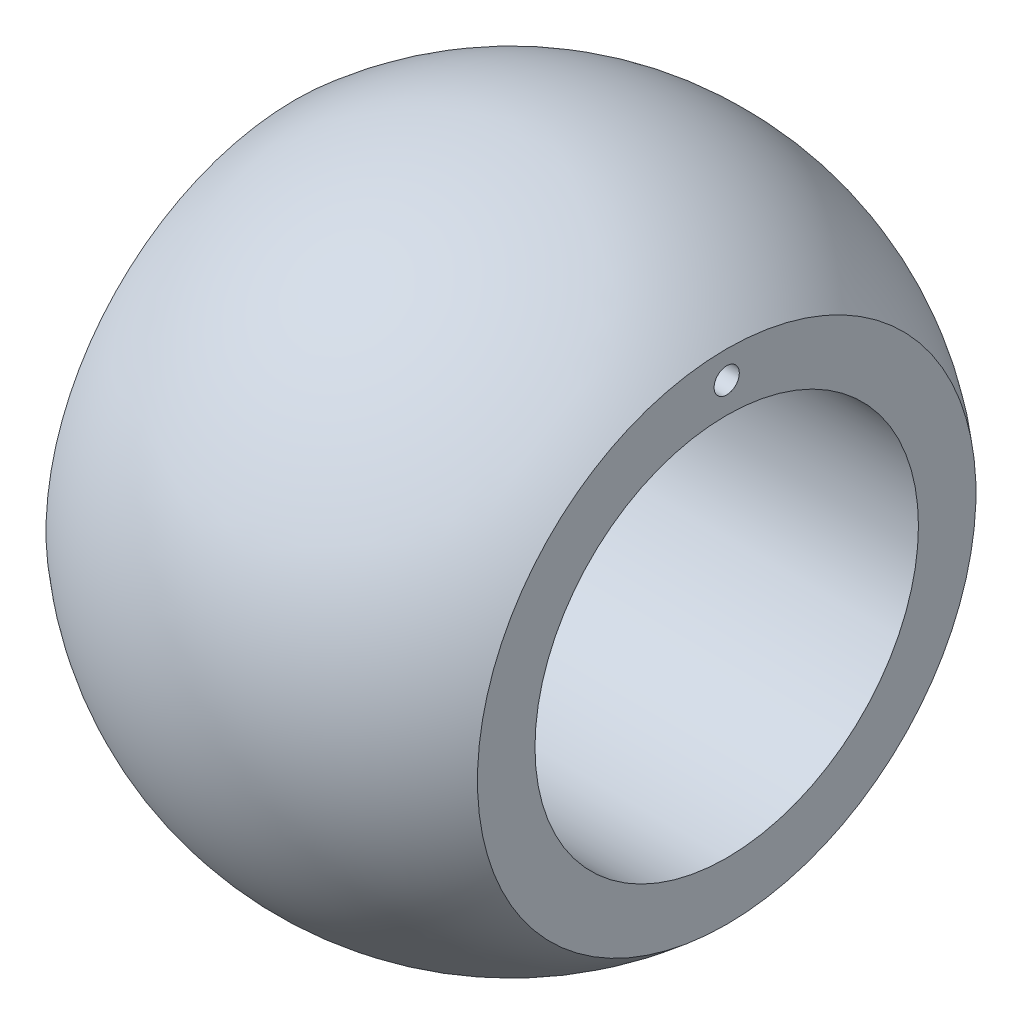
ISO-10303-21;
HEADER;
FILE_DESCRIPTION(('STEP AP214'),'2;1');
FILE_NAME('part.step','',(''),(''),'','','');
FILE_SCHEMA(('AUTOMOTIVE_DESIGN { 1 0 10303 214 1 1 1 1 }'));
ENDSEC;
DATA;
#1=APPLICATION_CONTEXT('core data for automotive mechanical design processes');
#2=APPLICATION_PROTOCOL_DEFINITION('international standard','automotive_design',2000,#1);
#3=PRODUCT_CONTEXT('',#1,'mechanical');
#4=PRODUCT('Part','Part','',(#3));
#5=PRODUCT_RELATED_PRODUCT_CATEGORY('part','',(#4));
#6=PRODUCT_DEFINITION_FORMATION('','',#4);
#7=PRODUCT_DEFINITION_CONTEXT('part definition',#1,'design');
#8=PRODUCT_DEFINITION('design','',#6,#7);
#9=PRODUCT_DEFINITION_SHAPE('','',#8);
#10=(LENGTH_UNIT() NAMED_UNIT(*) SI_UNIT(.MILLI.,.METRE.));
#11=(NAMED_UNIT(*) PLANE_ANGLE_UNIT() SI_UNIT($,.RADIAN.));
#12=(NAMED_UNIT(*) SI_UNIT($,.STERADIAN.) SOLID_ANGLE_UNIT());
#13=UNCERTAINTY_MEASURE_WITH_UNIT(LENGTH_MEASURE(1.E-05),#10,'distance_accuracy_value','');
#14=(GEOMETRIC_REPRESENTATION_CONTEXT(3) GLOBAL_UNCERTAINTY_ASSIGNED_CONTEXT((#13)) GLOBAL_UNIT_ASSIGNED_CONTEXT((#10,
#11,#12)) REPRESENTATION_CONTEXT('',''));
#15=CARTESIAN_POINT('',(0.,0.,0.));
#16=DIRECTION('',(0.,0.,1.));
#17=DIRECTION('',(1.,0.,0.));
#18=AXIS2_PLACEMENT_3D('',#15,#16,#17);
#19=CARTESIAN_POINT('',(0.,0.,0.));
#20=DIRECTION('',(-1.,0.,0.));
#21=DIRECTION('',(0.,1.,0.));
#22=AXIS2_PLACEMENT_3D('',#19,#20,#21);
#23=SPHERICAL_SURFACE('',#22,6.87677249878168);
#24=CARTESIAN_POINT('',(-4.5,0.,0.));
#25=DIRECTION('',(-1.,0.,0.));
#26=DIRECTION('',(0.,-1.,0.));
#27=AXIS2_PLACEMENT_3D('',#24,#25,#26);
#28=CIRCLE('',#27,5.2);
#29=CARTESIAN_POINT('',(-4.5,-5.2,0.));
#30=VERTEX_POINT('',#29);
#31=EDGE_CURVE('E51',#30,#30,#28,.T.);
#32=ORIENTED_EDGE('',*,*,#31,.F.);
#33=EDGE_LOOP('',(#32));
#34=FACE_BOUND('',#33,.T.);
#35=CARTESIAN_POINT('',(4.49999999999999,0.,0.));
#36=DIRECTION('',(-1.,0.,0.));
#37=DIRECTION('',(0.,-1.,0.));
#38=AXIS2_PLACEMENT_3D('',#35,#36,#37);
#39=CIRCLE('',#38,5.2);
#40=CARTESIAN_POINT('',(4.5,-5.2,0.));
#41=VERTEX_POINT('',#40);
#42=EDGE_CURVE('E10',#41,#41,#39,.T.);
#43=ORIENTED_EDGE('',*,*,#42,.T.);
#44=EDGE_LOOP('',(#43));
#45=FACE_BOUND('',#44,.T.);
#46=ADVANCED_FACE('F37',(#34,#45),#23,.T.);
#47=CARTESIAN_POINT('',(4.5,5.2,0.));
#48=DIRECTION('',(-1.,0.,0.));
#49=DIRECTION('',(0.,-1.,0.));
#50=AXIS2_PLACEMENT_3D('',#47,#48,#49);
#51=PLANE('',#50);
#52=CARTESIAN_POINT('',(4.5,4.63,0.));
#53=DIRECTION('',(-1.,0.,0.));
#54=DIRECTION('',(0.,-1.,0.));
#55=AXIS2_PLACEMENT_3D('',#52,#53,#54);
#56=CIRCLE('',#55,0.262991614352404);
#57=CARTESIAN_POINT('',(4.5,4.3670083856476,0.));
#58=VERTEX_POINT('',#57);
#59=EDGE_CURVE('E56',#58,#58,#56,.T.);
#60=ORIENTED_EDGE('',*,*,#59,.T.);
#61=EDGE_LOOP('',(#60));
#62=FACE_BOUND('',#61,.T.);
#63=ORIENTED_EDGE('',*,*,#42,.F.);
#64=EDGE_LOOP('',(#63));
#65=FACE_BOUND('',#64,.T.);
#66=CARTESIAN_POINT('',(4.49999999999999,0.,0.));
#67=DIRECTION('',(-1.,0.,0.));
#68=DIRECTION('',(0.,-1.,0.));
#69=AXIS2_PLACEMENT_3D('',#66,#67,#68);
#70=CIRCLE('',#69,4.);
#71=CARTESIAN_POINT('',(4.5,-3.99999999999999,0.));
#72=VERTEX_POINT('',#71);
#73=EDGE_CURVE('E43',#72,#72,#70,.T.);
#74=ORIENTED_EDGE('',*,*,#73,.T.);
#75=EDGE_LOOP('',(#74));
#76=FACE_BOUND('',#75,.T.);
#77=ADVANCED_FACE('F72',(#62,#65,#76),#51,.F.);
#78=CARTESIAN_POINT('',(-6.87677249878169,0.,0.));
#79=DIRECTION('',(-1.,0.,0.));
#80=DIRECTION('',(0.,-1.,0.));
#81=AXIS2_PLACEMENT_3D('',#78,#79,#80);
#82=CYLINDRICAL_SURFACE('',#81,4.);
#83=ORIENTED_EDGE('',*,*,#73,.F.);
#84=EDGE_LOOP('',(#83));
#85=FACE_BOUND('',#84,.T.);
#86=CARTESIAN_POINT('',(-4.5,0.,0.));
#87=DIRECTION('',(-1.,0.,0.));
#88=DIRECTION('',(0.,-1.,0.));
#89=AXIS2_PLACEMENT_3D('',#86,#87,#88);
#90=CIRCLE('',#89,4.);
#91=CARTESIAN_POINT('',(-4.5,-4.,0.));
#92=VERTEX_POINT('',#91);
#93=EDGE_CURVE('E47',#92,#92,#90,.T.);
#94=ORIENTED_EDGE('',*,*,#93,.T.);
#95=EDGE_LOOP('',(#94));
#96=FACE_BOUND('',#95,.T.);
#97=ADVANCED_FACE('F75',(#85,#96),#82,.F.);
#98=CARTESIAN_POINT('',(-4.5,4.,0.));
#99=DIRECTION('',(1.,0.,0.));
#100=DIRECTION('',(0.,1.,0.));
#101=AXIS2_PLACEMENT_3D('',#98,#99,#100);
#102=PLANE('',#101);
#103=CARTESIAN_POINT('',(-4.5,4.63,0.));
#104=DIRECTION('',(1.,0.,0.));
#105=DIRECTION('',(0.,1.,0.));
#106=AXIS2_PLACEMENT_3D('',#103,#104,#105);
#107=CIRCLE('',#106,0.262991614352404);
#108=CARTESIAN_POINT('',(-4.5,4.8929916143524,0.));
#109=VERTEX_POINT('',#108);
#110=EDGE_CURVE('E59',#109,#109,#107,.T.);
#111=ORIENTED_EDGE('',*,*,#110,.T.);
#112=EDGE_LOOP('',(#111));
#113=FACE_BOUND('',#112,.T.);
#114=ORIENTED_EDGE('',*,*,#93,.F.);
#115=EDGE_LOOP('',(#114));
#116=FACE_BOUND('',#115,.T.);
#117=ORIENTED_EDGE('',*,*,#31,.T.);
#118=EDGE_LOOP('',(#117));
#119=FACE_BOUND('',#118,.T.);
#120=ADVANCED_FACE('F63',(#113,#116,#119),#102,.F.);
#121=CARTESIAN_POINT('',(-4.5,4.63,0.));
#122=DIRECTION('',(1.,0.,0.));
#123=DIRECTION('',(0.,1.,0.));
#124=AXIS2_PLACEMENT_3D('',#121,#122,#123);
#125=CYLINDRICAL_SURFACE('',#124,0.262991614352404);
#126=ORIENTED_EDGE('',*,*,#110,.F.);
#127=EDGE_LOOP('',(#126));
#128=FACE_BOUND('',#127,.T.);
#129=ORIENTED_EDGE('',*,*,#59,.F.);
#130=EDGE_LOOP('',(#129));
#131=FACE_BOUND('',#130,.T.);
#132=ADVANCED_FACE('F66',(#128,#131),#125,.F.);
#133=CLOSED_SHELL('',(#46,#77,#97,#120,#132));
#134=MANIFOLD_SOLID_BREP('B2',#133);
#135=ADVANCED_BREP_SHAPE_REPRESENTATION('',(#18,#134),#14);
#136=SHAPE_DEFINITION_REPRESENTATION(#9,#135);
ENDSEC;
END-ISO-10303-21;
